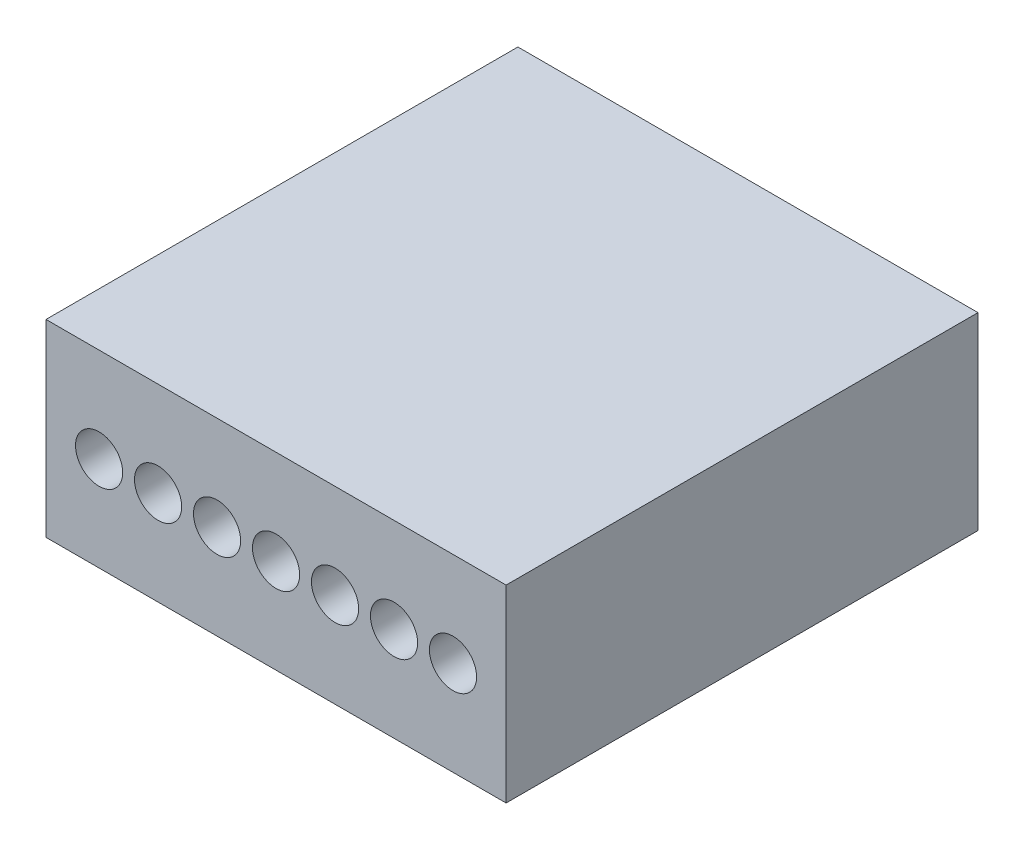
ISO-10303-21;
HEADER;
FILE_DESCRIPTION(('STEP AP214'),'2;1');
FILE_NAME('part.step','',(''),(''),'','','');
FILE_SCHEMA(('AUTOMOTIVE_DESIGN { 1 0 10303 214 1 1 1 1 }'));
ENDSEC;
DATA;
#1=APPLICATION_CONTEXT('core data for automotive mechanical design processes');
#2=APPLICATION_PROTOCOL_DEFINITION('international standard','automotive_design',2000,#1);
#3=PRODUCT_CONTEXT('',#1,'mechanical');
#4=PRODUCT('Part','Part','',(#3));
#5=PRODUCT_RELATED_PRODUCT_CATEGORY('part','',(#4));
#6=PRODUCT_DEFINITION_FORMATION('','',#4);
#7=PRODUCT_DEFINITION_CONTEXT('part definition',#1,'design');
#8=PRODUCT_DEFINITION('design','',#6,#7);
#9=PRODUCT_DEFINITION_SHAPE('','',#8);
#10=(LENGTH_UNIT() NAMED_UNIT(*) SI_UNIT(.MILLI.,.METRE.));
#11=(NAMED_UNIT(*) PLANE_ANGLE_UNIT() SI_UNIT($,.RADIAN.));
#12=(NAMED_UNIT(*) SI_UNIT($,.STERADIAN.) SOLID_ANGLE_UNIT());
#13=UNCERTAINTY_MEASURE_WITH_UNIT(LENGTH_MEASURE(1.E-05),#10,'distance_accuracy_value','');
#14=(GEOMETRIC_REPRESENTATION_CONTEXT(3) GLOBAL_UNCERTAINTY_ASSIGNED_CONTEXT((#13)) GLOBAL_UNIT_ASSIGNED_CONTEXT((#10,
#11,#12)) REPRESENTATION_CONTEXT('',''));
#15=CARTESIAN_POINT('',(0.,0.,0.));
#16=DIRECTION('',(0.,0.,1.));
#17=DIRECTION('',(1.,0.,0.));
#18=AXIS2_PLACEMENT_3D('',#15,#16,#17);
#19=CARTESIAN_POINT('',(0.,0.,10.));
#20=DIRECTION('',(1.,0.,0.));
#21=DIRECTION('',(0.,0.,-1.));
#22=AXIS2_PLACEMENT_3D('',#19,#20,#21);
#23=PLANE('',#22);
#24=DIRECTION('',(0.,-1.,0.));
#25=VECTOR('',#24,1.);
#26=CARTESIAN_POINT('',(0.,0.,0.));
#27=LINE('',#26,#25);
#28=CARTESIAN_POINT('',(0.,4.,0.));
#29=VERTEX_POINT('',#28);
#30=CARTESIAN_POINT('',(0.,0.,0.));
#31=VERTEX_POINT('',#30);
#32=EDGE_CURVE('E107',#29,#31,#27,.T.);
#33=ORIENTED_EDGE('',*,*,#32,.T.);
#34=DIRECTION('',(0.,0.,-1.));
#35=VECTOR('',#34,1.);
#36=CARTESIAN_POINT('',(0.,0.,10.));
#37=LINE('',#36,#35);
#38=CARTESIAN_POINT('',(0.,0.,10.));
#39=VERTEX_POINT('',#38);
#40=EDGE_CURVE('E11',#39,#31,#37,.T.);
#41=ORIENTED_EDGE('',*,*,#40,.F.);
#42=DIRECTION('',(0.,-1.,0.));
#43=VECTOR('',#42,1.);
#44=CARTESIAN_POINT('',(0.,0.,10.));
#45=LINE('',#44,#43);
#46=CARTESIAN_POINT('',(0.,4.,10.));
#47=VERTEX_POINT('',#46);
#48=EDGE_CURVE('E91',#47,#39,#45,.T.);
#49=ORIENTED_EDGE('',*,*,#48,.F.);
#50=DIRECTION('',(0.,0.,-1.));
#51=VECTOR('',#50,1.);
#52=CARTESIAN_POINT('',(0.,4.,10.));
#53=LINE('',#52,#51);
#54=EDGE_CURVE('E103',#47,#29,#53,.T.);
#55=ORIENTED_EDGE('',*,*,#54,.T.);
#56=EDGE_LOOP('',(#33,#41,#49,#55));
#57=FACE_BOUND('',#56,.T.);
#58=ADVANCED_FACE('F39',(#57),#23,.F.);
#59=CARTESIAN_POINT('',(0.,0.,10.));
#60=DIRECTION('',(0.,1.,0.));
#61=DIRECTION('',(0.,0.,1.));
#62=AXIS2_PLACEMENT_3D('',#59,#60,#61);
#63=PLANE('',#62);
#64=DIRECTION('',(1.,0.,0.));
#65=VECTOR('',#64,1.);
#66=CARTESIAN_POINT('',(0.,0.,0.));
#67=LINE('',#66,#65);
#68=CARTESIAN_POINT('',(9.75,0.,0.));
#69=VERTEX_POINT('',#68);
#70=EDGE_CURVE('E96',#31,#69,#67,.T.);
#71=ORIENTED_EDGE('',*,*,#70,.T.);
#72=DIRECTION('',(0.,0.,-1.));
#73=VECTOR('',#72,1.);
#74=CARTESIAN_POINT('',(9.75,0.,10.));
#75=LINE('',#74,#73);
#76=CARTESIAN_POINT('',(9.75,0.,10.));
#77=VERTEX_POINT('',#76);
#78=EDGE_CURVE('E48',#77,#69,#75,.T.);
#79=ORIENTED_EDGE('',*,*,#78,.F.);
#80=DIRECTION('',(1.,0.,0.));
#81=VECTOR('',#80,1.);
#82=CARTESIAN_POINT('',(0.,0.,10.));
#83=LINE('',#82,#81);
#84=EDGE_CURVE('E86',#39,#77,#83,.T.);
#85=ORIENTED_EDGE('',*,*,#84,.F.);
#86=ORIENTED_EDGE('',*,*,#40,.T.);
#87=EDGE_LOOP('',(#71,#79,#85,#86));
#88=FACE_BOUND('',#87,.T.);
#89=ADVANCED_FACE('F95',(#88),#63,.F.);
#90=CARTESIAN_POINT('',(9.75,0.,10.));
#91=DIRECTION('',(-1.,0.,0.));
#92=DIRECTION('',(0.,0.,1.));
#93=AXIS2_PLACEMENT_3D('',#90,#91,#92);
#94=PLANE('',#93);
#95=DIRECTION('',(0.,1.,0.));
#96=VECTOR('',#95,1.);
#97=CARTESIAN_POINT('',(9.75,0.,0.));
#98=LINE('',#97,#96);
#99=CARTESIAN_POINT('',(9.75,4.,0.));
#100=VERTEX_POINT('',#99);
#101=EDGE_CURVE('E73',#69,#100,#98,.T.);
#102=ORIENTED_EDGE('',*,*,#101,.T.);
#103=DIRECTION('',(0.,0.,-1.));
#104=VECTOR('',#103,1.);
#105=CARTESIAN_POINT('',(9.75,4.,10.));
#106=LINE('',#105,#104);
#107=CARTESIAN_POINT('',(9.75,4.,10.));
#108=VERTEX_POINT('',#107);
#109=EDGE_CURVE('E98',#108,#100,#106,.T.);
#110=ORIENTED_EDGE('',*,*,#109,.F.);
#111=DIRECTION('',(0.,1.,0.));
#112=VECTOR('',#111,1.);
#113=CARTESIAN_POINT('',(9.75,0.,10.));
#114=LINE('',#113,#112);
#115=EDGE_CURVE('E89',#77,#108,#114,.T.);
#116=ORIENTED_EDGE('',*,*,#115,.F.);
#117=ORIENTED_EDGE('',*,*,#78,.T.);
#118=EDGE_LOOP('',(#102,#110,#116,#117));
#119=FACE_BOUND('',#118,.T.);
#120=ADVANCED_FACE('F99',(#119),#94,.F.);
#121=CARTESIAN_POINT('',(0.,4.,10.));
#122=DIRECTION('',(0.,-1.,0.));
#123=DIRECTION('',(0.,0.,-1.));
#124=AXIS2_PLACEMENT_3D('',#121,#122,#123);
#125=PLANE('',#124);
#126=DIRECTION('',(-1.,0.,0.));
#127=VECTOR('',#126,1.);
#128=CARTESIAN_POINT('',(0.,4.,0.));
#129=LINE('',#128,#127);
#130=EDGE_CURVE('E79',#100,#29,#129,.T.);
#131=ORIENTED_EDGE('',*,*,#130,.T.);
#132=ORIENTED_EDGE('',*,*,#54,.F.);
#133=DIRECTION('',(-1.,0.,0.));
#134=VECTOR('',#133,1.);
#135=CARTESIAN_POINT('',(0.,4.,10.));
#136=LINE('',#135,#134);
#137=EDGE_CURVE('E56',#108,#47,#136,.T.);
#138=ORIENTED_EDGE('',*,*,#137,.F.);
#139=ORIENTED_EDGE('',*,*,#109,.T.);
#140=EDGE_LOOP('',(#131,#132,#138,#139));
#141=FACE_BOUND('',#140,.T.);
#142=ADVANCED_FACE('F121',(#141),#125,.F.);
#143=CARTESIAN_POINT('',(0.,0.,10.));
#144=DIRECTION('',(0.,0.,-1.));
#145=DIRECTION('',(-1.,0.,0.));
#146=AXIS2_PLACEMENT_3D('',#143,#144,#145);
#147=PLANE('',#146);
#148=CARTESIAN_POINT('',(1.125,2.,10.));
#149=DIRECTION('',(0.,0.,1.));
#150=DIRECTION('',(1.,0.,0.));
#151=AXIS2_PLACEMENT_3D('',#148,#149,#150);
#152=CIRCLE('',#151,0.5);
#153=CARTESIAN_POINT('',(1.625,2.,10.));
#154=VERTEX_POINT('',#153);
#155=EDGE_CURVE('E176',#154,#154,#152,.T.);
#156=ORIENTED_EDGE('',*,*,#155,.F.);
#157=EDGE_LOOP('',(#156));
#158=FACE_BOUND('',#157,.T.);
#159=CARTESIAN_POINT('',(2.375,2.,10.));
#160=DIRECTION('',(0.,0.,1.));
#161=DIRECTION('',(1.,0.,0.));
#162=AXIS2_PLACEMENT_3D('',#159,#160,#161);
#163=CIRCLE('',#162,0.5);
#164=CARTESIAN_POINT('',(2.875,2.,10.));
#165=VERTEX_POINT('',#164);
#166=EDGE_CURVE('E168',#165,#165,#163,.T.);
#167=ORIENTED_EDGE('',*,*,#166,.F.);
#168=EDGE_LOOP('',(#167));
#169=FACE_BOUND('',#168,.T.);
#170=CARTESIAN_POINT('',(3.625,2.,10.));
#171=DIRECTION('',(0.,0.,1.));
#172=DIRECTION('',(1.,0.,0.));
#173=AXIS2_PLACEMENT_3D('',#170,#171,#172);
#174=CIRCLE('',#173,0.5);
#175=CARTESIAN_POINT('',(4.125,2.,10.));
#176=VERTEX_POINT('',#175);
#177=EDGE_CURVE('E160',#176,#176,#174,.T.);
#178=ORIENTED_EDGE('',*,*,#177,.F.);
#179=EDGE_LOOP('',(#178));
#180=FACE_BOUND('',#179,.T.);
#181=CARTESIAN_POINT('',(4.875,2.,10.));
#182=DIRECTION('',(0.,0.,1.));
#183=DIRECTION('',(1.,0.,0.));
#184=AXIS2_PLACEMENT_3D('',#181,#182,#183);
#185=CIRCLE('',#184,0.5);
#186=CARTESIAN_POINT('',(5.375,2.,10.));
#187=VERTEX_POINT('',#186);
#188=EDGE_CURVE('E152',#187,#187,#185,.T.);
#189=ORIENTED_EDGE('',*,*,#188,.F.);
#190=EDGE_LOOP('',(#189));
#191=FACE_BOUND('',#190,.T.);
#192=CARTESIAN_POINT('',(6.125,2.,10.));
#193=DIRECTION('',(0.,0.,1.));
#194=DIRECTION('',(1.,0.,0.));
#195=AXIS2_PLACEMENT_3D('',#192,#193,#194);
#196=CIRCLE('',#195,0.5);
#197=CARTESIAN_POINT('',(6.625,2.,10.));
#198=VERTEX_POINT('',#197);
#199=EDGE_CURVE('E144',#198,#198,#196,.T.);
#200=ORIENTED_EDGE('',*,*,#199,.F.);
#201=EDGE_LOOP('',(#200));
#202=FACE_BOUND('',#201,.T.);
#203=CARTESIAN_POINT('',(7.375,2.,10.));
#204=DIRECTION('',(0.,0.,1.));
#205=DIRECTION('',(1.,0.,0.));
#206=AXIS2_PLACEMENT_3D('',#203,#204,#205);
#207=CIRCLE('',#206,0.500000000000002);
#208=CARTESIAN_POINT('',(7.875,2.,10.));
#209=VERTEX_POINT('',#208);
#210=EDGE_CURVE('E136',#209,#209,#207,.T.);
#211=ORIENTED_EDGE('',*,*,#210,.F.);
#212=EDGE_LOOP('',(#211));
#213=FACE_BOUND('',#212,.T.);
#214=CARTESIAN_POINT('',(8.625,2.,10.));
#215=DIRECTION('',(0.,0.,1.));
#216=DIRECTION('',(1.,0.,0.));
#217=AXIS2_PLACEMENT_3D('',#214,#215,#216);
#218=CIRCLE('',#217,0.499999999999999);
#219=CARTESIAN_POINT('',(9.125,2.,10.));
#220=VERTEX_POINT('',#219);
#221=EDGE_CURVE('E128',#220,#220,#218,.T.);
#222=ORIENTED_EDGE('',*,*,#221,.F.);
#223=EDGE_LOOP('',(#222));
#224=FACE_BOUND('',#223,.T.);
#225=ORIENTED_EDGE('',*,*,#48,.T.);
#226=ORIENTED_EDGE('',*,*,#84,.T.);
#227=ORIENTED_EDGE('',*,*,#115,.T.);
#228=ORIENTED_EDGE('',*,*,#137,.T.);
#229=EDGE_LOOP('',(#225,#226,#227,#228));
#230=FACE_BOUND('',#229,.T.);
#231=ADVANCED_FACE('F87',(#158,#169,#180,#191,#202,#213,#224,#230),#147,.F.);
#232=CARTESIAN_POINT('',(0.,0.,0.));
#233=DIRECTION('',(0.,0.,-1.));
#234=DIRECTION('',(-1.,0.,0.));
#235=AXIS2_PLACEMENT_3D('',#232,#233,#234);
#236=PLANE('',#235);
#237=ORIENTED_EDGE('',*,*,#32,.F.);
#238=ORIENTED_EDGE('',*,*,#130,.F.);
#239=ORIENTED_EDGE('',*,*,#101,.F.);
#240=ORIENTED_EDGE('',*,*,#70,.F.);
#241=EDGE_LOOP('',(#237,#238,#239,#240));
#242=FACE_BOUND('',#241,.T.);
#243=ADVANCED_FACE('F124',(#242),#236,.T.);
#244=CARTESIAN_POINT('',(8.625,2.,5.));
#245=DIRECTION('',(0.,0.,1.));
#246=DIRECTION('',(1.,0.,0.));
#247=AXIS2_PLACEMENT_3D('',#244,#245,#246);
#248=CYLINDRICAL_SURFACE('',#247,0.499999999999999);
#249=CARTESIAN_POINT('',(8.625,2.,5.));
#250=DIRECTION('',(0.,0.,1.));
#251=DIRECTION('',(1.,0.,0.));
#252=AXIS2_PLACEMENT_3D('',#249,#250,#251);
#253=CIRCLE('',#252,0.499999999999999);
#254=CARTESIAN_POINT('',(9.125,2.,5.));
#255=VERTEX_POINT('',#254);
#256=EDGE_CURVE('E132',#255,#255,#253,.T.);
#257=ORIENTED_EDGE('',*,*,#256,.F.);
#258=EDGE_LOOP('',(#257));
#259=FACE_BOUND('',#258,.T.);
#260=ORIENTED_EDGE('',*,*,#221,.T.);
#261=EDGE_LOOP('',(#260));
#262=FACE_BOUND('',#261,.T.);
#263=ADVANCED_FACE('F208',(#259,#262),#248,.F.);
#264=CARTESIAN_POINT('',(8.625,2.,5.));
#265=DIRECTION('',(0.,0.,1.));
#266=DIRECTION('',(1.,0.,0.));
#267=AXIS2_PLACEMENT_3D('',#264,#265,#266);
#268=PLANE('',#267);
#269=ORIENTED_EDGE('',*,*,#256,.T.);
#270=EDGE_LOOP('',(#269));
#271=FACE_BOUND('',#270,.T.);
#272=ADVANCED_FACE('F210',(#271),#268,.T.);
#273=CARTESIAN_POINT('',(7.375,2.,5.));
#274=DIRECTION('',(0.,0.,1.));
#275=DIRECTION('',(1.,0.,0.));
#276=AXIS2_PLACEMENT_3D('',#273,#274,#275);
#277=CYLINDRICAL_SURFACE('',#276,0.500000000000002);
#278=CARTESIAN_POINT('',(7.375,2.,5.));
#279=DIRECTION('',(0.,0.,1.));
#280=DIRECTION('',(1.,0.,0.));
#281=AXIS2_PLACEMENT_3D('',#278,#279,#280);
#282=CIRCLE('',#281,0.500000000000002);
#283=CARTESIAN_POINT('',(7.875,2.,5.));
#284=VERTEX_POINT('',#283);
#285=EDGE_CURVE('E140',#284,#284,#282,.T.);
#286=ORIENTED_EDGE('',*,*,#285,.F.);
#287=EDGE_LOOP('',(#286));
#288=FACE_BOUND('',#287,.T.);
#289=ORIENTED_EDGE('',*,*,#210,.T.);
#290=EDGE_LOOP('',(#289));
#291=FACE_BOUND('',#290,.T.);
#292=ADVANCED_FACE('F217',(#288,#291),#277,.F.);
#293=CARTESIAN_POINT('',(7.375,2.,5.));
#294=DIRECTION('',(0.,0.,1.));
#295=DIRECTION('',(1.,0.,0.));
#296=AXIS2_PLACEMENT_3D('',#293,#294,#295);
#297=PLANE('',#296);
#298=ORIENTED_EDGE('',*,*,#285,.T.);
#299=EDGE_LOOP('',(#298));
#300=FACE_BOUND('',#299,.T.);
#301=ADVANCED_FACE('F265',(#300),#297,.T.);
#302=CARTESIAN_POINT('',(6.125,2.,5.));
#303=DIRECTION('',(0.,0.,1.));
#304=DIRECTION('',(1.,0.,0.));
#305=AXIS2_PLACEMENT_3D('',#302,#303,#304);
#306=CYLINDRICAL_SURFACE('',#305,0.5);
#307=CARTESIAN_POINT('',(6.125,2.,5.));
#308=DIRECTION('',(0.,0.,1.));
#309=DIRECTION('',(1.,0.,0.));
#310=AXIS2_PLACEMENT_3D('',#307,#308,#309);
#311=CIRCLE('',#310,0.5);
#312=CARTESIAN_POINT('',(6.625,2.,5.));
#313=VERTEX_POINT('',#312);
#314=EDGE_CURVE('E148',#313,#313,#311,.T.);
#315=ORIENTED_EDGE('',*,*,#314,.F.);
#316=EDGE_LOOP('',(#315));
#317=FACE_BOUND('',#316,.T.);
#318=ORIENTED_EDGE('',*,*,#199,.T.);
#319=EDGE_LOOP('',(#318));
#320=FACE_BOUND('',#319,.T.);
#321=ADVANCED_FACE('F274',(#317,#320),#306,.F.);
#322=CARTESIAN_POINT('',(6.125,2.,5.));
#323=DIRECTION('',(0.,0.,1.));
#324=DIRECTION('',(1.,0.,0.));
#325=AXIS2_PLACEMENT_3D('',#322,#323,#324);
#326=PLANE('',#325);
#327=ORIENTED_EDGE('',*,*,#314,.T.);
#328=EDGE_LOOP('',(#327));
#329=FACE_BOUND('',#328,.T.);
#330=ADVANCED_FACE('F283',(#329),#326,.T.);
#331=CARTESIAN_POINT('',(4.875,2.,5.));
#332=DIRECTION('',(0.,0.,1.));
#333=DIRECTION('',(1.,0.,0.));
#334=AXIS2_PLACEMENT_3D('',#331,#332,#333);
#335=CYLINDRICAL_SURFACE('',#334,0.5);
#336=CARTESIAN_POINT('',(4.875,2.,5.));
#337=DIRECTION('',(0.,0.,1.));
#338=DIRECTION('',(1.,0.,0.));
#339=AXIS2_PLACEMENT_3D('',#336,#337,#338);
#340=CIRCLE('',#339,0.5);
#341=CARTESIAN_POINT('',(5.375,2.,5.));
#342=VERTEX_POINT('',#341);
#343=EDGE_CURVE('E156',#342,#342,#340,.T.);
#344=ORIENTED_EDGE('',*,*,#343,.F.);
#345=EDGE_LOOP('',(#344));
#346=FACE_BOUND('',#345,.T.);
#347=ORIENTED_EDGE('',*,*,#188,.T.);
#348=EDGE_LOOP('',(#347));
#349=FACE_BOUND('',#348,.T.);
#350=ADVANCED_FACE('F292',(#346,#349),#335,.F.);
#351=CARTESIAN_POINT('',(4.875,2.,5.));
#352=DIRECTION('',(0.,0.,1.));
#353=DIRECTION('',(1.,0.,0.));
#354=AXIS2_PLACEMENT_3D('',#351,#352,#353);
#355=PLANE('',#354);
#356=ORIENTED_EDGE('',*,*,#343,.T.);
#357=EDGE_LOOP('',(#356));
#358=FACE_BOUND('',#357,.T.);
#359=ADVANCED_FACE('F301',(#358),#355,.T.);
#360=CARTESIAN_POINT('',(3.625,2.,5.));
#361=DIRECTION('',(0.,0.,1.));
#362=DIRECTION('',(1.,0.,0.));
#363=AXIS2_PLACEMENT_3D('',#360,#361,#362);
#364=CYLINDRICAL_SURFACE('',#363,0.5);
#365=CARTESIAN_POINT('',(3.625,2.,5.));
#366=DIRECTION('',(0.,0.,1.));
#367=DIRECTION('',(1.,0.,0.));
#368=AXIS2_PLACEMENT_3D('',#365,#366,#367);
#369=CIRCLE('',#368,0.5);
#370=CARTESIAN_POINT('',(4.125,2.,5.));
#371=VERTEX_POINT('',#370);
#372=EDGE_CURVE('E164',#371,#371,#369,.T.);
#373=ORIENTED_EDGE('',*,*,#372,.F.);
#374=EDGE_LOOP('',(#373));
#375=FACE_BOUND('',#374,.T.);
#376=ORIENTED_EDGE('',*,*,#177,.T.);
#377=EDGE_LOOP('',(#376));
#378=FACE_BOUND('',#377,.T.);
#379=ADVANCED_FACE('F310',(#375,#378),#364,.F.);
#380=CARTESIAN_POINT('',(3.625,2.,5.));
#381=DIRECTION('',(0.,0.,1.));
#382=DIRECTION('',(1.,0.,0.));
#383=AXIS2_PLACEMENT_3D('',#380,#381,#382);
#384=PLANE('',#383);
#385=ORIENTED_EDGE('',*,*,#372,.T.);
#386=EDGE_LOOP('',(#385));
#387=FACE_BOUND('',#386,.T.);
#388=ADVANCED_FACE('F319',(#387),#384,.T.);
#389=CARTESIAN_POINT('',(2.375,2.,5.));
#390=DIRECTION('',(0.,0.,1.));
#391=DIRECTION('',(1.,0.,0.));
#392=AXIS2_PLACEMENT_3D('',#389,#390,#391);
#393=CYLINDRICAL_SURFACE('',#392,0.5);
#394=CARTESIAN_POINT('',(2.375,2.,5.));
#395=DIRECTION('',(0.,0.,1.));
#396=DIRECTION('',(1.,0.,0.));
#397=AXIS2_PLACEMENT_3D('',#394,#395,#396);
#398=CIRCLE('',#397,0.5);
#399=CARTESIAN_POINT('',(2.875,2.,5.));
#400=VERTEX_POINT('',#399);
#401=EDGE_CURVE('E172',#400,#400,#398,.T.);
#402=ORIENTED_EDGE('',*,*,#401,.F.);
#403=EDGE_LOOP('',(#402));
#404=FACE_BOUND('',#403,.T.);
#405=ORIENTED_EDGE('',*,*,#166,.T.);
#406=EDGE_LOOP('',(#405));
#407=FACE_BOUND('',#406,.T.);
#408=ADVANCED_FACE('F328',(#404,#407),#393,.F.);
#409=CARTESIAN_POINT('',(2.375,2.,5.));
#410=DIRECTION('',(0.,0.,1.));
#411=DIRECTION('',(1.,0.,0.));
#412=AXIS2_PLACEMENT_3D('',#409,#410,#411);
#413=PLANE('',#412);
#414=ORIENTED_EDGE('',*,*,#401,.T.);
#415=EDGE_LOOP('',(#414));
#416=FACE_BOUND('',#415,.T.);
#417=ADVANCED_FACE('F189',(#416),#413,.T.);
#418=CARTESIAN_POINT('',(1.125,2.,5.));
#419=DIRECTION('',(0.,0.,1.));
#420=DIRECTION('',(1.,0.,0.));
#421=AXIS2_PLACEMENT_3D('',#418,#419,#420);
#422=CYLINDRICAL_SURFACE('',#421,0.5);
#423=CARTESIAN_POINT('',(1.125,2.,5.));
#424=DIRECTION('',(0.,0.,1.));
#425=DIRECTION('',(1.,0.,0.));
#426=AXIS2_PLACEMENT_3D('',#423,#424,#425);
#427=CIRCLE('',#426,0.5);
#428=CARTESIAN_POINT('',(1.625,2.,5.));
#429=VERTEX_POINT('',#428);
#430=EDGE_CURVE('E111',#429,#429,#427,.T.);
#431=ORIENTED_EDGE('',*,*,#430,.F.);
#432=EDGE_LOOP('',(#431));
#433=FACE_BOUND('',#432,.T.);
#434=ORIENTED_EDGE('',*,*,#155,.T.);
#435=EDGE_LOOP('',(#434));
#436=FACE_BOUND('',#435,.T.);
#437=ADVANCED_FACE('F186',(#433,#436),#422,.F.);
#438=CARTESIAN_POINT('',(1.125,2.,5.));
#439=DIRECTION('',(0.,0.,1.));
#440=DIRECTION('',(1.,0.,0.));
#441=AXIS2_PLACEMENT_3D('',#438,#439,#440);
#442=PLANE('',#441);
#443=ORIENTED_EDGE('',*,*,#430,.T.);
#444=EDGE_LOOP('',(#443));
#445=FACE_BOUND('',#444,.T.);
#446=ADVANCED_FACE('F184',(#445),#442,.T.);
#447=CLOSED_SHELL('',(#58,#89,#120,#142,#231,#243,#263,#272,#292,#301,#321,#330,#350,#359,#379,
#388,#408,#417,#437,#446));
#448=MANIFOLD_SOLID_BREP('B2',#447);
#449=ADVANCED_BREP_SHAPE_REPRESENTATION('',(#18,#448),#14);
#450=SHAPE_DEFINITION_REPRESENTATION(#9,#449);
ENDSEC;
END-ISO-10303-21;
